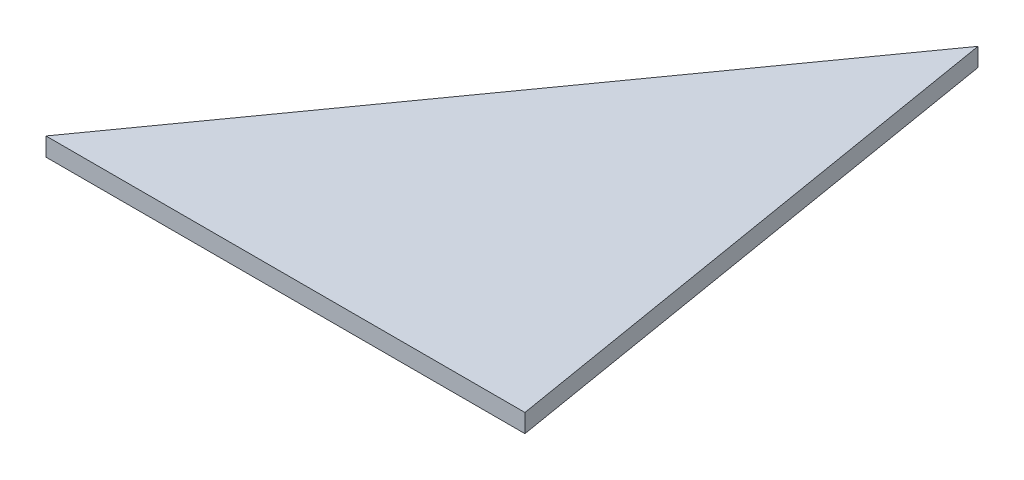
ISO-10303-21;
HEADER;
FILE_DESCRIPTION(('STEP AP214'),'2;1');
FILE_NAME('part.step','',(''),(''),'','','');
FILE_SCHEMA(('AUTOMOTIVE_DESIGN { 1 0 10303 214 1 1 1 1 }'));
ENDSEC;
DATA;
#1=APPLICATION_CONTEXT('core data for automotive mechanical design processes');
#2=APPLICATION_PROTOCOL_DEFINITION('international standard','automotive_design',2000,#1);
#3=PRODUCT_CONTEXT('',#1,'mechanical');
#4=PRODUCT('Part','Part','',(#3));
#5=PRODUCT_RELATED_PRODUCT_CATEGORY('part','',(#4));
#6=PRODUCT_DEFINITION_FORMATION('','',#4);
#7=PRODUCT_DEFINITION_CONTEXT('part definition',#1,'design');
#8=PRODUCT_DEFINITION('design','',#6,#7);
#9=PRODUCT_DEFINITION_SHAPE('','',#8);
#10=(LENGTH_UNIT() NAMED_UNIT(*) SI_UNIT(.MILLI.,.METRE.));
#11=(NAMED_UNIT(*) PLANE_ANGLE_UNIT() SI_UNIT($,.RADIAN.));
#12=(NAMED_UNIT(*) SI_UNIT($,.STERADIAN.) SOLID_ANGLE_UNIT());
#13=UNCERTAINTY_MEASURE_WITH_UNIT(LENGTH_MEASURE(1.E-05),#10,'distance_accuracy_value','');
#14=(GEOMETRIC_REPRESENTATION_CONTEXT(3) GLOBAL_UNCERTAINTY_ASSIGNED_CONTEXT((#13)) GLOBAL_UNIT_ASSIGNED_CONTEXT((#10,
#11,#12)) REPRESENTATION_CONTEXT('',''));
#15=CARTESIAN_POINT('',(0.,0.,0.));
#16=DIRECTION('',(0.,0.,1.));
#17=DIRECTION('',(1.,0.,0.));
#18=AXIS2_PLACEMENT_3D('',#15,#16,#17);
#19=CARTESIAN_POINT('',(42.2805579751871,2.,-59.1843035358327));
#20=DIRECTION('',(0.813694092818682,0.,0.581293319514324));
#21=DIRECTION('',(0.581293319514324,0.,-0.813694092818682));
#22=AXIS2_PLACEMENT_3D('',#19,#20,#21);
#23=PLANE('',#22);
#24=DIRECTION('',(-0.581293319514324,0.,0.813694092818682));
#25=VECTOR('',#24,1.);
#26=CARTESIAN_POINT('',(42.2805579751871,0.,-59.1843035358327));
#27=LINE('',#26,#25);
#28=CARTESIAN_POINT('',(42.2805579751871,0.,-59.1843035358327));
#29=VERTEX_POINT('',#28);
#30=CARTESIAN_POINT('',(0.,0.,0.));
#31=VERTEX_POINT('',#30);
#32=EDGE_CURVE('E89',#29,#31,#27,.T.);
#33=ORIENTED_EDGE('',*,*,#32,.T.);
#34=DIRECTION('',(0.,-1.,0.));
#35=VECTOR('',#34,1.);
#36=CARTESIAN_POINT('',(0.,2.,0.));
#37=LINE('',#36,#35);
#38=CARTESIAN_POINT('',(0.,2.,0.));
#39=VERTEX_POINT('',#38);
#40=EDGE_CURVE('E11',#39,#31,#37,.T.);
#41=ORIENTED_EDGE('',*,*,#40,.F.);
#42=DIRECTION('',(-0.581293319514324,0.,0.813694092818682));
#43=VECTOR('',#42,1.);
#44=CARTESIAN_POINT('',(42.2805579751871,2.,-59.1843035358327));
#45=LINE('',#44,#43);
#46=CARTESIAN_POINT('',(42.2805579751871,2.,-59.1843035358327));
#47=VERTEX_POINT('',#46);
#48=EDGE_CURVE('E81',#47,#39,#45,.T.);
#49=ORIENTED_EDGE('',*,*,#48,.F.);
#50=DIRECTION('',(0.,-1.,0.));
#51=VECTOR('',#50,1.);
#52=CARTESIAN_POINT('',(42.2805579751871,2.,-59.1843035358327));
#53=LINE('',#52,#51);
#54=EDGE_CURVE('E90',#47,#29,#53,.T.);
#55=ORIENTED_EDGE('',*,*,#54,.T.);
#56=EDGE_LOOP('',(#33,#41,#49,#55));
#57=FACE_BOUND('',#56,.T.);
#58=ADVANCED_FACE('F39',(#57),#23,.F.);
#59=CARTESIAN_POINT('',(0.,2.,0.));
#60=DIRECTION('',(0.,0.,-1.));
#61=DIRECTION('',(-1.,0.,0.));
#62=AXIS2_PLACEMENT_3D('',#59,#60,#61);
#63=PLANE('',#62);
#64=DIRECTION('',(1.,0.,0.));
#65=VECTOR('',#64,1.);
#66=CARTESIAN_POINT('',(0.,0.,0.));
#67=LINE('',#66,#65);
#68=CARTESIAN_POINT('',(52.1404877405777,0.,0.));
#69=VERTEX_POINT('',#68);
#70=EDGE_CURVE('E68',#31,#69,#67,.T.);
#71=ORIENTED_EDGE('',*,*,#70,.T.);
#72=DIRECTION('',(0.,-1.,0.));
#73=VECTOR('',#72,1.);
#74=CARTESIAN_POINT('',(52.1404877405777,2.,0.));
#75=LINE('',#74,#73);
#76=CARTESIAN_POINT('',(52.1404877405777,2.,0.));
#77=VERTEX_POINT('',#76);
#78=EDGE_CURVE('E48',#77,#69,#75,.T.);
#79=ORIENTED_EDGE('',*,*,#78,.F.);
#80=DIRECTION('',(1.,0.,0.));
#81=VECTOR('',#80,1.);
#82=CARTESIAN_POINT('',(0.,2.,0.));
#83=LINE('',#82,#81);
#84=EDGE_CURVE('E76',#39,#77,#83,.T.);
#85=ORIENTED_EDGE('',*,*,#84,.F.);
#86=ORIENTED_EDGE('',*,*,#40,.T.);
#87=EDGE_LOOP('',(#71,#79,#85,#86));
#88=FACE_BOUND('',#87,.T.);
#89=ADVANCED_FACE('F77',(#88),#63,.F.);
#90=CARTESIAN_POINT('',(52.1404877405777,2.,0.));
#91=DIRECTION('',(-0.986405058930543,0.,0.16433216275651));
#92=DIRECTION('',(0.16433216275651,0.,0.986405058930543));
#93=AXIS2_PLACEMENT_3D('',#90,#91,#92);
#94=PLANE('',#93);
#95=DIRECTION('',(-0.16433216275651,0.,-0.986405058930543));
#96=VECTOR('',#95,1.);
#97=CARTESIAN_POINT('',(52.1404877405777,0.,0.));
#98=LINE('',#97,#96);
#99=EDGE_CURVE('E73',#69,#29,#98,.T.);
#100=ORIENTED_EDGE('',*,*,#99,.T.);
#101=ORIENTED_EDGE('',*,*,#54,.F.);
#102=DIRECTION('',(-0.16433216275651,0.,-0.986405058930543));
#103=VECTOR('',#102,1.);
#104=CARTESIAN_POINT('',(52.1404877405777,2.,0.));
#105=LINE('',#104,#103);
#106=EDGE_CURVE('E56',#77,#47,#105,.T.);
#107=ORIENTED_EDGE('',*,*,#106,.F.);
#108=ORIENTED_EDGE('',*,*,#78,.T.);
#109=EDGE_LOOP('',(#100,#101,#107,#108));
#110=FACE_BOUND('',#109,.T.);
#111=ADVANCED_FACE('F102',(#110),#94,.F.);
#112=CARTESIAN_POINT('',(0.,2.,0.));
#113=DIRECTION('',(0.,1.,0.));
#114=DIRECTION('',(0.,0.,1.));
#115=AXIS2_PLACEMENT_3D('',#112,#113,#114);
#116=PLANE('',#115);
#117=ORIENTED_EDGE('',*,*,#48,.T.);
#118=ORIENTED_EDGE('',*,*,#84,.T.);
#119=ORIENTED_EDGE('',*,*,#106,.T.);
#120=EDGE_LOOP('',(#117,#118,#119));
#121=FACE_BOUND('',#120,.T.);
#122=ADVANCED_FACE('F84',(#121),#116,.T.);
#123=CARTESIAN_POINT('',(0.,0.,0.));
#124=DIRECTION('',(0.,1.,0.));
#125=DIRECTION('',(0.,0.,1.));
#126=AXIS2_PLACEMENT_3D('',#123,#124,#125);
#127=PLANE('',#126);
#128=ORIENTED_EDGE('',*,*,#32,.F.);
#129=ORIENTED_EDGE('',*,*,#99,.F.);
#130=ORIENTED_EDGE('',*,*,#70,.F.);
#131=EDGE_LOOP('',(#128,#129,#130));
#132=FACE_BOUND('',#131,.T.);
#133=ADVANCED_FACE('F103',(#132),#127,.F.);
#134=CLOSED_SHELL('',(#58,#89,#111,#122,#133));
#135=MANIFOLD_SOLID_BREP('B2',#134);
#136=ADVANCED_BREP_SHAPE_REPRESENTATION('',(#18,#135),#14);
#137=SHAPE_DEFINITION_REPRESENTATION(#9,#136);
ENDSEC;
END-ISO-10303-21;
